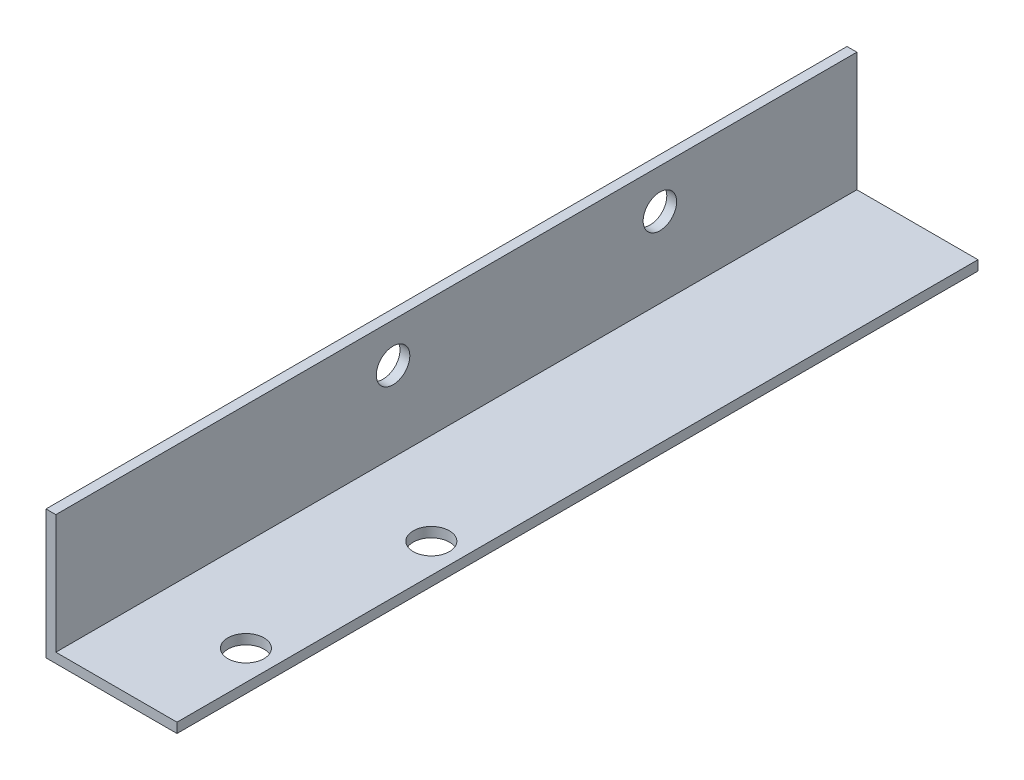
ISO-10303-21;
HEADER;
FILE_DESCRIPTION(('STEP AP214'),'2;1');
FILE_NAME('part.step','',(''),(''),'','','');
FILE_SCHEMA(('AUTOMOTIVE_DESIGN { 1 0 10303 214 1 1 1 1 }'));
ENDSEC;
DATA;
#1=APPLICATION_CONTEXT('core data for automotive mechanical design processes');
#2=APPLICATION_PROTOCOL_DEFINITION('international standard','automotive_design',2000,#1);
#3=PRODUCT_CONTEXT('',#1,'mechanical');
#4=PRODUCT('Part','Part','',(#3));
#5=PRODUCT_RELATED_PRODUCT_CATEGORY('part','',(#4));
#6=PRODUCT_DEFINITION_FORMATION('','',#4);
#7=PRODUCT_DEFINITION_CONTEXT('part definition',#1,'design');
#8=PRODUCT_DEFINITION('design','',#6,#7);
#9=PRODUCT_DEFINITION_SHAPE('','',#8);
#10=(LENGTH_UNIT() NAMED_UNIT(*) SI_UNIT(.MILLI.,.METRE.));
#11=(NAMED_UNIT(*) PLANE_ANGLE_UNIT() SI_UNIT($,.RADIAN.));
#12=(NAMED_UNIT(*) SI_UNIT($,.STERADIAN.) SOLID_ANGLE_UNIT());
#13=UNCERTAINTY_MEASURE_WITH_UNIT(LENGTH_MEASURE(1.E-05),#10,'distance_accuracy_value','');
#14=(GEOMETRIC_REPRESENTATION_CONTEXT(3) GLOBAL_UNCERTAINTY_ASSIGNED_CONTEXT((#13)) GLOBAL_UNIT_ASSIGNED_CONTEXT((#10,
#11,#12)) REPRESENTATION_CONTEXT('',''));
#15=CARTESIAN_POINT('',(0.,0.,0.));
#16=DIRECTION('',(0.,0.,1.));
#17=DIRECTION('',(1.,0.,0.));
#18=AXIS2_PLACEMENT_3D('',#15,#16,#17);
#19=CARTESIAN_POINT('',(-1.5,18.15,122.));
#20=DIRECTION('',(0.,-1.,0.));
#21=DIRECTION('',(0.,0.,-1.));
#22=AXIS2_PLACEMENT_3D('',#19,#20,#21);
#23=PLANE('',#22);
#24=DIRECTION('',(-1.,0.,0.));
#25=VECTOR('',#24,1.);
#26=CARTESIAN_POINT('',(-1.5,18.15,0.));
#27=LINE('',#26,#25);
#28=CARTESIAN_POINT('',(0.,18.15,0.));
#29=VERTEX_POINT('',#28);
#30=CARTESIAN_POINT('',(-1.5,18.15,0.));
#31=VERTEX_POINT('',#30);
#32=EDGE_CURVE('E122',#29,#31,#27,.T.);
#33=ORIENTED_EDGE('',*,*,#32,.T.);
#34=DIRECTION('',(0.,0.,-1.));
#35=VECTOR('',#34,1.);
#36=CARTESIAN_POINT('',(-1.5,18.15,122.));
#37=LINE('',#36,#35);
#38=CARTESIAN_POINT('',(-1.5,18.15,122.));
#39=VERTEX_POINT('',#38);
#40=EDGE_CURVE('E11',#39,#31,#37,.T.);
#41=ORIENTED_EDGE('',*,*,#40,.F.);
#42=DIRECTION('',(-1.,0.,0.));
#43=VECTOR('',#42,1.);
#44=CARTESIAN_POINT('',(-1.5,18.15,122.));
#45=LINE('',#44,#43);
#46=CARTESIAN_POINT('',(0.,18.15,122.));
#47=VERTEX_POINT('',#46);
#48=EDGE_CURVE('E133',#47,#39,#45,.T.);
#49=ORIENTED_EDGE('',*,*,#48,.F.);
#50=DIRECTION('',(0.,0.,-1.));
#51=VECTOR('',#50,1.);
#52=CARTESIAN_POINT('',(0.,18.15,122.));
#53=LINE('',#52,#51);
#54=EDGE_CURVE('E118',#47,#29,#53,.T.);
#55=ORIENTED_EDGE('',*,*,#54,.T.);
#56=EDGE_LOOP('',(#33,#41,#49,#55));
#57=FACE_BOUND('',#56,.T.);
#58=ADVANCED_FACE('F36',(#57),#23,.F.);
#59=CARTESIAN_POINT('',(-1.5,18.15,122.));
#60=DIRECTION('',(1.,0.,0.));
#61=DIRECTION('',(0.,1.,0.));
#62=AXIS2_PLACEMENT_3D('',#59,#60,#61);
#63=PLANE('',#62);
#64=CARTESIAN_POINT('',(-1.5,12.15,30.));
#65=DIRECTION('',(-1.,0.,0.));
#66=DIRECTION('',(0.,-1.,0.));
#67=AXIS2_PLACEMENT_3D('',#64,#65,#66);
#68=CIRCLE('',#67,2.54999999999999);
#69=CARTESIAN_POINT('',(-1.5,9.60000000000001,30.));
#70=VERTEX_POINT('',#69);
#71=EDGE_CURVE('E146',#70,#70,#68,.T.);
#72=ORIENTED_EDGE('',*,*,#71,.F.);
#73=EDGE_LOOP('',(#72));
#74=FACE_BOUND('',#73,.T.);
#75=CARTESIAN_POINT('',(-1.5,12.15,70.64));
#76=DIRECTION('',(-1.,0.,0.));
#77=DIRECTION('',(0.,-1.,0.));
#78=AXIS2_PLACEMENT_3D('',#75,#76,#77);
#79=CIRCLE('',#78,2.54999999999999);
#80=CARTESIAN_POINT('',(-1.5,9.60000000000001,70.64));
#81=VERTEX_POINT('',#80);
#82=EDGE_CURVE('E152',#81,#81,#79,.T.);
#83=ORIENTED_EDGE('',*,*,#82,.F.);
#84=EDGE_LOOP('',(#83));
#85=FACE_BOUND('',#84,.T.);
#86=DIRECTION('',(0.,-1.,0.));
#87=VECTOR('',#86,1.);
#88=CARTESIAN_POINT('',(-1.5,18.15,0.));
#89=LINE('',#88,#87);
#90=CARTESIAN_POINT('',(-1.5,-1.5,0.));
#91=VERTEX_POINT('',#90);
#92=EDGE_CURVE('E125',#31,#91,#89,.T.);
#93=ORIENTED_EDGE('',*,*,#92,.T.);
#94=DIRECTION('',(0.,0.,-1.));
#95=VECTOR('',#94,1.);
#96=CARTESIAN_POINT('',(-1.5,-1.5,122.));
#97=LINE('',#96,#95);
#98=CARTESIAN_POINT('',(-1.5,-1.5,122.));
#99=VERTEX_POINT('',#98);
#100=EDGE_CURVE('E45',#99,#91,#97,.T.);
#101=ORIENTED_EDGE('',*,*,#100,.F.);
#102=DIRECTION('',(0.,-1.,0.));
#103=VECTOR('',#102,1.);
#104=CARTESIAN_POINT('',(-1.5,18.15,122.));
#105=LINE('',#104,#103);
#106=EDGE_CURVE('E91',#39,#99,#105,.T.);
#107=ORIENTED_EDGE('',*,*,#106,.F.);
#108=ORIENTED_EDGE('',*,*,#40,.T.);
#109=EDGE_LOOP('',(#93,#101,#107,#108));
#110=FACE_BOUND('',#109,.T.);
#111=ADVANCED_FACE('F166',(#74,#85,#110),#63,.F.);
#112=CARTESIAN_POINT('',(-1.5,-1.5,122.));
#113=DIRECTION('',(0.,1.,0.));
#114=DIRECTION('',(0.,0.,1.));
#115=AXIS2_PLACEMENT_3D('',#112,#113,#114);
#116=PLANE('',#115);
#117=CARTESIAN_POINT('',(13.95,-1.5,107.));
#118=DIRECTION('',(0.,-1.,0.));
#119=DIRECTION('',(0.,0.,-1.));
#120=AXIS2_PLACEMENT_3D('',#117,#118,#119);
#121=CIRCLE('',#120,2.75);
#122=CARTESIAN_POINT('',(13.95,-1.5,104.25));
#123=VERTEX_POINT('',#122);
#124=EDGE_CURVE('E142',#123,#123,#121,.T.);
#125=ORIENTED_EDGE('',*,*,#124,.F.);
#126=EDGE_LOOP('',(#125));
#127=FACE_BOUND('',#126,.T.);
#128=CARTESIAN_POINT('',(13.95,-1.5,78.76));
#129=DIRECTION('',(0.,-1.,0.));
#130=DIRECTION('',(0.,0.,-1.));
#131=AXIS2_PLACEMENT_3D('',#128,#129,#130);
#132=CIRCLE('',#131,2.75);
#133=CARTESIAN_POINT('',(13.95,-1.5,76.01));
#134=VERTEX_POINT('',#133);
#135=EDGE_CURVE('E150',#134,#134,#132,.T.);
#136=ORIENTED_EDGE('',*,*,#135,.F.);
#137=EDGE_LOOP('',(#136));
#138=FACE_BOUND('',#137,.T.);
#139=DIRECTION('',(1.,0.,0.));
#140=VECTOR('',#139,1.);
#141=CARTESIAN_POINT('',(-1.5,-1.5,0.));
#142=LINE('',#141,#140);
#143=CARTESIAN_POINT('',(18.45,-1.5,0.));
#144=VERTEX_POINT('',#143);
#145=EDGE_CURVE('E128',#91,#144,#142,.T.);
#146=ORIENTED_EDGE('',*,*,#145,.T.);
#147=DIRECTION('',(0.,0.,-1.));
#148=VECTOR('',#147,1.);
#149=CARTESIAN_POINT('',(18.45,-1.5,122.));
#150=LINE('',#149,#148);
#151=CARTESIAN_POINT('',(18.45,-1.5,122.));
#152=VERTEX_POINT('',#151);
#153=EDGE_CURVE('E113',#152,#144,#150,.T.);
#154=ORIENTED_EDGE('',*,*,#153,.F.);
#155=DIRECTION('',(1.,0.,0.));
#156=VECTOR('',#155,1.);
#157=CARTESIAN_POINT('',(-1.5,-1.5,122.));
#158=LINE('',#157,#156);
#159=EDGE_CURVE('E104',#99,#152,#158,.T.);
#160=ORIENTED_EDGE('',*,*,#159,.F.);
#161=ORIENTED_EDGE('',*,*,#100,.T.);
#162=EDGE_LOOP('',(#146,#154,#160,#161));
#163=FACE_BOUND('',#162,.T.);
#164=ADVANCED_FACE('F169',(#127,#138,#163),#116,.F.);
#165=CARTESIAN_POINT('',(18.45,0.,122.));
#166=DIRECTION('',(-1.,0.,0.));
#167=DIRECTION('',(0.,0.,1.));
#168=AXIS2_PLACEMENT_3D('',#165,#166,#167);
#169=PLANE('',#168);
#170=DIRECTION('',(0.,1.,0.));
#171=VECTOR('',#170,1.);
#172=CARTESIAN_POINT('',(18.45,0.,0.));
#173=LINE('',#172,#171);
#174=CARTESIAN_POINT('',(18.45,0.,0.));
#175=VERTEX_POINT('',#174);
#176=EDGE_CURVE('E112',#144,#175,#173,.T.);
#177=ORIENTED_EDGE('',*,*,#176,.T.);
#178=DIRECTION('',(0.,0.,-1.));
#179=VECTOR('',#178,1.);
#180=CARTESIAN_POINT('',(18.45,0.,122.));
#181=LINE('',#180,#179);
#182=CARTESIAN_POINT('',(18.45,0.,122.));
#183=VERTEX_POINT('',#182);
#184=EDGE_CURVE('E109',#183,#175,#181,.T.);
#185=ORIENTED_EDGE('',*,*,#184,.F.);
#186=DIRECTION('',(0.,1.,0.));
#187=VECTOR('',#186,1.);
#188=CARTESIAN_POINT('',(18.45,0.,122.));
#189=LINE('',#188,#187);
#190=EDGE_CURVE('E98',#152,#183,#189,.T.);
#191=ORIENTED_EDGE('',*,*,#190,.F.);
#192=ORIENTED_EDGE('',*,*,#153,.T.);
#193=EDGE_LOOP('',(#177,#185,#191,#192));
#194=FACE_BOUND('',#193,.T.);
#195=ADVANCED_FACE('F110',(#194),#169,.F.);
#196=CARTESIAN_POINT('',(0.,0.,122.));
#197=DIRECTION('',(0.,-1.,0.));
#198=DIRECTION('',(0.,0.,-1.));
#199=AXIS2_PLACEMENT_3D('',#196,#197,#198);
#200=PLANE('',#199);
#201=CARTESIAN_POINT('',(13.95,0.,107.));
#202=DIRECTION('',(0.,-1.,0.));
#203=DIRECTION('',(0.,0.,-1.));
#204=AXIS2_PLACEMENT_3D('',#201,#202,#203);
#205=CIRCLE('',#204,2.75);
#206=CARTESIAN_POINT('',(13.95,0.,104.25));
#207=VERTEX_POINT('',#206);
#208=EDGE_CURVE('E126',#207,#207,#205,.T.);
#209=ORIENTED_EDGE('',*,*,#208,.T.);
#210=EDGE_LOOP('',(#209));
#211=FACE_BOUND('',#210,.T.);
#212=CARTESIAN_POINT('',(13.95,0.,78.76));
#213=DIRECTION('',(0.,-1.,0.));
#214=DIRECTION('',(0.,0.,-1.));
#215=AXIS2_PLACEMENT_3D('',#212,#213,#214);
#216=CIRCLE('',#215,2.75);
#217=CARTESIAN_POINT('',(13.95,0.,76.01));
#218=VERTEX_POINT('',#217);
#219=EDGE_CURVE('E139',#218,#218,#216,.T.);
#220=ORIENTED_EDGE('',*,*,#219,.T.);
#221=EDGE_LOOP('',(#220));
#222=FACE_BOUND('',#221,.T.);
#223=DIRECTION('',(-1.,0.,0.));
#224=VECTOR('',#223,1.);
#225=CARTESIAN_POINT('',(0.,0.,0.));
#226=LINE('',#225,#224);
#227=CARTESIAN_POINT('',(0.,0.,0.));
#228=VERTEX_POINT('',#227);
#229=EDGE_CURVE('E77',#175,#228,#226,.T.);
#230=ORIENTED_EDGE('',*,*,#229,.T.);
#231=DIRECTION('',(0.,0.,-1.));
#232=VECTOR('',#231,1.);
#233=CARTESIAN_POINT('',(0.,0.,122.));
#234=LINE('',#233,#232);
#235=CARTESIAN_POINT('',(0.,0.,122.));
#236=VERTEX_POINT('',#235);
#237=EDGE_CURVE('E114',#236,#228,#234,.T.);
#238=ORIENTED_EDGE('',*,*,#237,.F.);
#239=DIRECTION('',(-1.,0.,0.));
#240=VECTOR('',#239,1.);
#241=CARTESIAN_POINT('',(0.,0.,122.));
#242=LINE('',#241,#240);
#243=EDGE_CURVE('E102',#183,#236,#242,.T.);
#244=ORIENTED_EDGE('',*,*,#243,.F.);
#245=ORIENTED_EDGE('',*,*,#184,.T.);
#246=EDGE_LOOP('',(#230,#238,#244,#245));
#247=FACE_BOUND('',#246,.T.);
#248=ADVANCED_FACE('F116',(#211,#222,#247),#200,.F.);
#249=CARTESIAN_POINT('',(0.,18.15,122.));
#250=DIRECTION('',(-1.,0.,0.));
#251=DIRECTION('',(0.,-1.,0.));
#252=AXIS2_PLACEMENT_3D('',#249,#250,#251);
#253=PLANE('',#252);
#254=CARTESIAN_POINT('',(0.,12.15,30.));
#255=DIRECTION('',(-1.,0.,0.));
#256=DIRECTION('',(0.,-1.,0.));
#257=AXIS2_PLACEMENT_3D('',#254,#255,#256);
#258=CIRCLE('',#257,2.54999999999999);
#259=CARTESIAN_POINT('',(0.,9.60000000000001,30.));
#260=VERTEX_POINT('',#259);
#261=EDGE_CURVE('E39',#260,#260,#258,.T.);
#262=ORIENTED_EDGE('',*,*,#261,.T.);
#263=EDGE_LOOP('',(#262));
#264=FACE_BOUND('',#263,.T.);
#265=CARTESIAN_POINT('',(0.,12.15,70.64));
#266=DIRECTION('',(-1.,0.,0.));
#267=DIRECTION('',(0.,-1.,0.));
#268=AXIS2_PLACEMENT_3D('',#265,#266,#267);
#269=CIRCLE('',#268,2.54999999999999);
#270=CARTESIAN_POINT('',(0.,9.60000000000001,70.64));
#271=VERTEX_POINT('',#270);
#272=EDGE_CURVE('E144',#271,#271,#269,.T.);
#273=ORIENTED_EDGE('',*,*,#272,.T.);
#274=EDGE_LOOP('',(#273));
#275=FACE_BOUND('',#274,.T.);
#276=DIRECTION('',(0.,1.,0.));
#277=VECTOR('',#276,1.);
#278=CARTESIAN_POINT('',(0.,18.15,0.));
#279=LINE('',#278,#277);
#280=EDGE_CURVE('E83',#228,#29,#279,.T.);
#281=ORIENTED_EDGE('',*,*,#280,.T.);
#282=ORIENTED_EDGE('',*,*,#54,.F.);
#283=DIRECTION('',(0.,1.,0.));
#284=VECTOR('',#283,1.);
#285=CARTESIAN_POINT('',(0.,18.15,122.));
#286=LINE('',#285,#284);
#287=EDGE_CURVE('E54',#236,#47,#286,.T.);
#288=ORIENTED_EDGE('',*,*,#287,.F.);
#289=ORIENTED_EDGE('',*,*,#237,.T.);
#290=EDGE_LOOP('',(#281,#282,#288,#289));
#291=FACE_BOUND('',#290,.T.);
#292=ADVANCED_FACE('F174',(#264,#275,#291),#253,.F.);
#293=CARTESIAN_POINT('',(0.,0.,122.));
#294=DIRECTION('',(0.,0.,-1.));
#295=DIRECTION('',(-1.,0.,0.));
#296=AXIS2_PLACEMENT_3D('',#293,#294,#295);
#297=PLANE('',#296);
#298=ORIENTED_EDGE('',*,*,#48,.T.);
#299=ORIENTED_EDGE('',*,*,#106,.T.);
#300=ORIENTED_EDGE('',*,*,#159,.T.);
#301=ORIENTED_EDGE('',*,*,#190,.T.);
#302=ORIENTED_EDGE('',*,*,#243,.T.);
#303=ORIENTED_EDGE('',*,*,#287,.T.);
#304=EDGE_LOOP('',(#298,#299,#300,#301,#302,#303));
#305=FACE_BOUND('',#304,.T.);
#306=ADVANCED_FACE('F100',(#305),#297,.F.);
#307=CARTESIAN_POINT('',(0.,0.,0.));
#308=DIRECTION('',(0.,0.,-1.));
#309=DIRECTION('',(-1.,0.,0.));
#310=AXIS2_PLACEMENT_3D('',#307,#308,#309);
#311=PLANE('',#310);
#312=ORIENTED_EDGE('',*,*,#32,.F.);
#313=ORIENTED_EDGE('',*,*,#280,.F.);
#314=ORIENTED_EDGE('',*,*,#229,.F.);
#315=ORIENTED_EDGE('',*,*,#176,.F.);
#316=ORIENTED_EDGE('',*,*,#145,.F.);
#317=ORIENTED_EDGE('',*,*,#92,.F.);
#318=EDGE_LOOP('',(#312,#313,#314,#315,#316,#317));
#319=FACE_BOUND('',#318,.T.);
#320=ADVANCED_FACE('F172',(#319),#311,.T.);
#321=CARTESIAN_POINT('',(13.95,18.15,78.76));
#322=DIRECTION('',(0.,-1.,0.));
#323=DIRECTION('',(0.,0.,-1.));
#324=AXIS2_PLACEMENT_3D('',#321,#322,#323);
#325=CYLINDRICAL_SURFACE('',#324,2.75);
#326=ORIENTED_EDGE('',*,*,#135,.T.);
#327=EDGE_LOOP('',(#326));
#328=FACE_BOUND('',#327,.T.);
#329=ORIENTED_EDGE('',*,*,#219,.F.);
#330=EDGE_LOOP('',(#329));
#331=FACE_BOUND('',#330,.T.);
#332=ADVANCED_FACE('F218',(#328,#331),#325,.F.);
#333=CARTESIAN_POINT('',(13.95,18.15,107.));
#334=DIRECTION('',(0.,-1.,0.));
#335=DIRECTION('',(0.,0.,-1.));
#336=AXIS2_PLACEMENT_3D('',#333,#334,#335);
#337=CYLINDRICAL_SURFACE('',#336,2.75);
#338=ORIENTED_EDGE('',*,*,#124,.T.);
#339=EDGE_LOOP('',(#338));
#340=FACE_BOUND('',#339,.T.);
#341=ORIENTED_EDGE('',*,*,#208,.F.);
#342=EDGE_LOOP('',(#341));
#343=FACE_BOUND('',#342,.T.);
#344=ADVANCED_FACE('F223',(#340,#343),#337,.F.);
#345=CARTESIAN_POINT('',(18.45,12.15,70.64));
#346=DIRECTION('',(-1.,0.,0.));
#347=DIRECTION('',(0.,-1.,0.));
#348=AXIS2_PLACEMENT_3D('',#345,#346,#347);
#349=CYLINDRICAL_SURFACE('',#348,2.54999999999999);
#350=ORIENTED_EDGE('',*,*,#82,.T.);
#351=EDGE_LOOP('',(#350));
#352=FACE_BOUND('',#351,.T.);
#353=ORIENTED_EDGE('',*,*,#272,.F.);
#354=EDGE_LOOP('',(#353));
#355=FACE_BOUND('',#354,.T.);
#356=ADVANCED_FACE('F235',(#352,#355),#349,.F.);
#357=CARTESIAN_POINT('',(18.45,12.15,30.));
#358=DIRECTION('',(-1.,0.,0.));
#359=DIRECTION('',(0.,-1.,0.));
#360=AXIS2_PLACEMENT_3D('',#357,#358,#359);
#361=CYLINDRICAL_SURFACE('',#360,2.54999999999999);
#362=ORIENTED_EDGE('',*,*,#71,.T.);
#363=EDGE_LOOP('',(#362));
#364=FACE_BOUND('',#363,.T.);
#365=ORIENTED_EDGE('',*,*,#261,.F.);
#366=EDGE_LOOP('',(#365));
#367=FACE_BOUND('',#366,.T.);
#368=ADVANCED_FACE('F258',(#364,#367),#361,.F.);
#369=CLOSED_SHELL('',(#58,#111,#164,#195,#248,#292,#306,#320,#332,#344,#356,#368));
#370=MANIFOLD_SOLID_BREP('B2',#369);
#371=ADVANCED_BREP_SHAPE_REPRESENTATION('',(#18,#370),#14);
#372=SHAPE_DEFINITION_REPRESENTATION(#9,#371);
ENDSEC;
END-ISO-10303-21;
